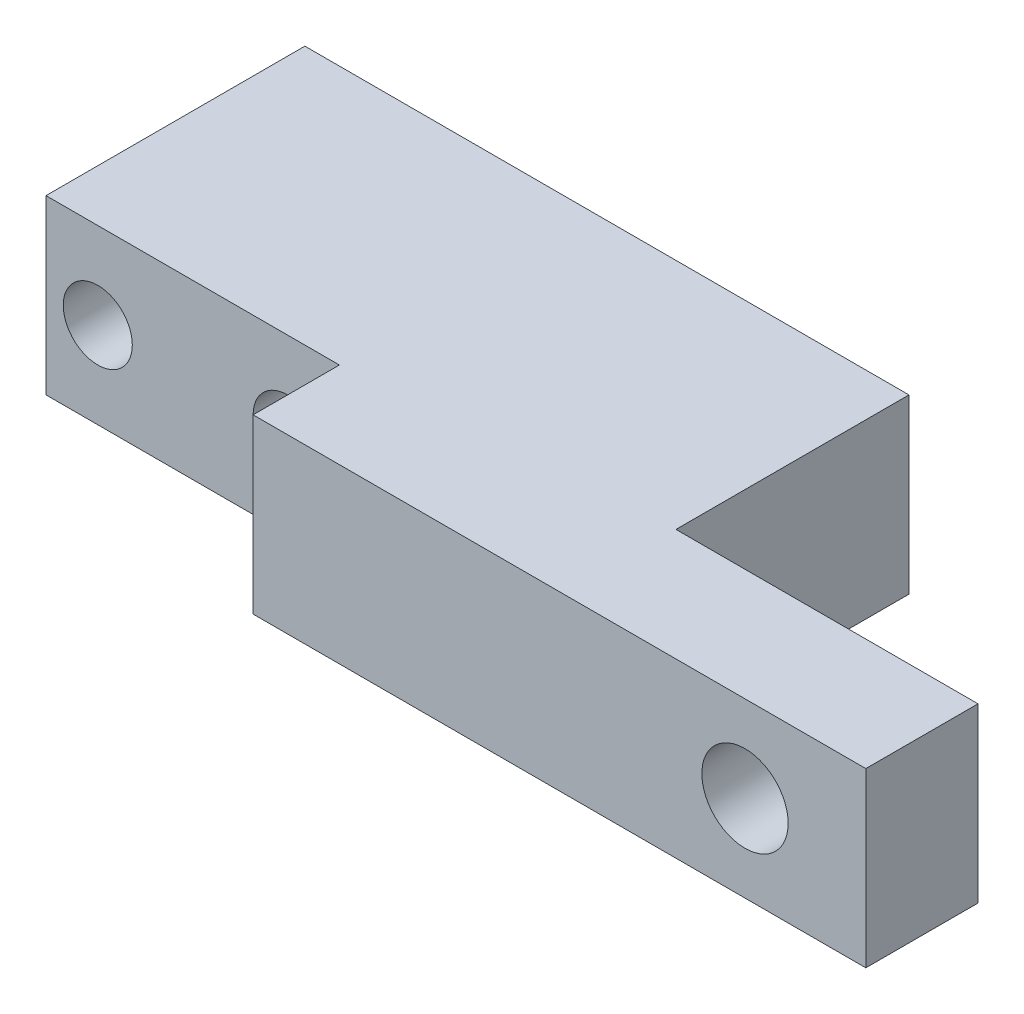
ISO-10303-21;
HEADER;
FILE_DESCRIPTION(('STEP AP214'),'2;1');
FILE_NAME('part.step','',(''),(''),'','','');
FILE_SCHEMA(('AUTOMOTIVE_DESIGN { 1 0 10303 214 1 1 1 1 }'));
ENDSEC;
DATA;
#1=APPLICATION_CONTEXT('core data for automotive mechanical design processes');
#2=APPLICATION_PROTOCOL_DEFINITION('international standard','automotive_design',2000,#1);
#3=PRODUCT_CONTEXT('',#1,'mechanical');
#4=PRODUCT('Part','Part','',(#3));
#5=PRODUCT_RELATED_PRODUCT_CATEGORY('part','',(#4));
#6=PRODUCT_DEFINITION_FORMATION('','',#4);
#7=PRODUCT_DEFINITION_CONTEXT('part definition',#1,'design');
#8=PRODUCT_DEFINITION('design','',#6,#7);
#9=PRODUCT_DEFINITION_SHAPE('','',#8);
#10=(LENGTH_UNIT() NAMED_UNIT(*) SI_UNIT(.MILLI.,.METRE.));
#11=(NAMED_UNIT(*) PLANE_ANGLE_UNIT() SI_UNIT($,.RADIAN.));
#12=(NAMED_UNIT(*) SI_UNIT($,.STERADIAN.) SOLID_ANGLE_UNIT());
#13=UNCERTAINTY_MEASURE_WITH_UNIT(LENGTH_MEASURE(1.E-05),#10,'distance_accuracy_value','');
#14=(GEOMETRIC_REPRESENTATION_CONTEXT(3) GLOBAL_UNCERTAINTY_ASSIGNED_CONTEXT((#13)) GLOBAL_UNIT_ASSIGNED_CONTEXT((#10,
#11,#12)) REPRESENTATION_CONTEXT('',''));
#15=CARTESIAN_POINT('',(0.,0.,0.));
#16=DIRECTION('',(0.,0.,1.));
#17=DIRECTION('',(1.,0.,0.));
#18=AXIS2_PLACEMENT_3D('',#15,#16,#17);
#19=CARTESIAN_POINT('',(0.,-10.,20.));
#20=DIRECTION('',(1.,0.,0.));
#21=DIRECTION('',(0.,0.,-1.));
#22=AXIS2_PLACEMENT_3D('',#19,#20,#21);
#23=PLANE('',#22);
#24=DIRECTION('',(0.,0.,-1.));
#25=VECTOR('',#24,1.);
#26=CARTESIAN_POINT('',(0.,-10.,20.));
#27=LINE('',#26,#25);
#28=CARTESIAN_POINT('',(0.,-10.,15.));
#29=VERTEX_POINT('',#28);
#30=CARTESIAN_POINT('',(0.,-10.,0.));
#31=VERTEX_POINT('',#30);
#32=EDGE_CURVE('E11',#29,#31,#27,.T.);
#33=ORIENTED_EDGE('',*,*,#32,.F.);
#34=DIRECTION('',(0.,1.,0.));
#35=VECTOR('',#34,1.);
#36=CARTESIAN_POINT('',(0.,-20.,15.));
#37=LINE('',#36,#35);
#38=CARTESIAN_POINT('',(0.,0.,15.));
#39=VERTEX_POINT('',#38);
#40=EDGE_CURVE('E132',#29,#39,#37,.T.);
#41=ORIENTED_EDGE('',*,*,#40,.T.);
#42=DIRECTION('',(0.,0.,-1.));
#43=VECTOR('',#42,1.);
#44=CARTESIAN_POINT('',(0.,0.,20.));
#45=LINE('',#44,#43);
#46=CARTESIAN_POINT('',(0.,0.,0.));
#47=VERTEX_POINT('',#46);
#48=EDGE_CURVE('E164',#39,#47,#45,.T.);
#49=ORIENTED_EDGE('',*,*,#48,.T.);
#50=DIRECTION('',(0.,-1.,0.));
#51=VECTOR('',#50,1.);
#52=CARTESIAN_POINT('',(0.,-10.,0.));
#53=LINE('',#52,#51);
#54=EDGE_CURVE('E155',#47,#31,#53,.T.);
#55=ORIENTED_EDGE('',*,*,#54,.T.);
#56=EDGE_LOOP('',(#33,#41,#49,#55));
#57=FACE_BOUND('',#56,.T.);
#58=ADVANCED_FACE('F33',(#57),#23,.F.);
#59=CARTESIAN_POINT('',(52.5,-9.99999999999999,20.));
#60=DIRECTION('',(0.,1.,0.));
#61=DIRECTION('',(-1.,0.,0.));
#62=AXIS2_PLACEMENT_3D('',#59,#60,#61);
#63=PLANE('',#62);
#64=DIRECTION('',(1.,0.,0.));
#65=VECTOR('',#64,1.);
#66=CARTESIAN_POINT('',(52.5,-9.99999999999999,0.));
#67=LINE('',#66,#65);
#68=CARTESIAN_POINT('',(35.,-9.99999999999999,0.));
#69=VERTEX_POINT('',#68);
#70=EDGE_CURVE('E167',#31,#69,#67,.T.);
#71=ORIENTED_EDGE('',*,*,#70,.T.);
#72=DIRECTION('',(0.,0.,1.));
#73=VECTOR('',#72,1.);
#74=CARTESIAN_POINT('',(35.,-9.99999999999999,20.));
#75=LINE('',#74,#73);
#76=CARTESIAN_POINT('',(35.,-9.99999999999999,13.5));
#77=VERTEX_POINT('',#76);
#78=EDGE_CURVE('E49',#69,#77,#75,.T.);
#79=ORIENTED_EDGE('',*,*,#78,.T.);
#80=DIRECTION('',(1.,0.,0.));
#81=VECTOR('',#80,1.);
#82=CARTESIAN_POINT('',(52.5,-9.99999999999999,13.5));
#83=LINE('',#82,#81);
#84=CARTESIAN_POINT('',(52.5,-9.99999999999999,13.5));
#85=VERTEX_POINT('',#84);
#86=EDGE_CURVE('E105',#77,#85,#83,.T.);
#87=ORIENTED_EDGE('',*,*,#86,.T.);
#88=DIRECTION('',(0.,0.,-1.));
#89=VECTOR('',#88,1.);
#90=CARTESIAN_POINT('',(52.5,-9.99999999999999,20.));
#91=LINE('',#90,#89);
#92=CARTESIAN_POINT('',(52.5,-9.99999999999999,20.));
#93=VERTEX_POINT('',#92);
#94=EDGE_CURVE('E41',#93,#85,#91,.T.);
#95=ORIENTED_EDGE('',*,*,#94,.F.);
#96=DIRECTION('',(1.,0.,0.));
#97=VECTOR('',#96,1.);
#98=CARTESIAN_POINT('',(52.5,-9.99999999999999,20.));
#99=LINE('',#98,#97);
#100=CARTESIAN_POINT('',(17.,-10.,20.));
#101=VERTEX_POINT('',#100);
#102=EDGE_CURVE('E156',#101,#93,#99,.T.);
#103=ORIENTED_EDGE('',*,*,#102,.F.);
#104=DIRECTION('',(0.,0.,-1.));
#105=VECTOR('',#104,1.);
#106=CARTESIAN_POINT('',(17.,-10.,20.));
#107=LINE('',#106,#105);
#108=CARTESIAN_POINT('',(17.,-10.,15.));
#109=VERTEX_POINT('',#108);
#110=EDGE_CURVE('E57',#101,#109,#107,.T.);
#111=ORIENTED_EDGE('',*,*,#110,.T.);
#112=DIRECTION('',(-1.,0.,0.));
#113=VECTOR('',#112,1.);
#114=CARTESIAN_POINT('',(52.5,-9.99999999999999,15.));
#115=LINE('',#114,#113);
#116=EDGE_CURVE('E142',#109,#29,#115,.T.);
#117=ORIENTED_EDGE('',*,*,#116,.T.);
#118=ORIENTED_EDGE('',*,*,#32,.T.);
#119=EDGE_LOOP('',(#71,#79,#87,#95,#103,#111,#117,#118));
#120=FACE_BOUND('',#119,.T.);
#121=ADVANCED_FACE('F198',(#120),#63,.F.);
#122=CARTESIAN_POINT('',(52.5,0.,20.));
#123=DIRECTION('',(-1.,0.,0.));
#124=DIRECTION('',(0.,0.,1.));
#125=AXIS2_PLACEMENT_3D('',#122,#123,#124);
#126=PLANE('',#125);
#127=ORIENTED_EDGE('',*,*,#94,.T.);
#128=DIRECTION('',(0.,1.,0.));
#129=VECTOR('',#128,1.);
#130=CARTESIAN_POINT('',(52.5,-20.,13.5));
#131=LINE('',#130,#129);
#132=CARTESIAN_POINT('',(52.5,0.,13.5));
#133=VERTEX_POINT('',#132);
#134=EDGE_CURVE('E106',#85,#133,#131,.T.);
#135=ORIENTED_EDGE('',*,*,#134,.T.);
#136=DIRECTION('',(0.,0.,-1.));
#137=VECTOR('',#136,1.);
#138=CARTESIAN_POINT('',(52.5,0.,20.));
#139=LINE('',#138,#137);
#140=CARTESIAN_POINT('',(52.5,0.,20.));
#141=VERTEX_POINT('',#140);
#142=EDGE_CURVE('E119',#141,#133,#139,.T.);
#143=ORIENTED_EDGE('',*,*,#142,.F.);
#144=DIRECTION('',(0.,1.,0.));
#145=VECTOR('',#144,1.);
#146=CARTESIAN_POINT('',(52.5,0.,20.));
#147=LINE('',#146,#145);
#148=EDGE_CURVE('E158',#93,#141,#147,.T.);
#149=ORIENTED_EDGE('',*,*,#148,.F.);
#150=EDGE_LOOP('',(#127,#135,#143,#149));
#151=FACE_BOUND('',#150,.T.);
#152=ADVANCED_FACE('F205',(#151),#126,.F.);
#153=CARTESIAN_POINT('',(0.,0.,20.));
#154=DIRECTION('',(0.,-1.,0.));
#155=DIRECTION('',(0.,0.,-1.));
#156=AXIS2_PLACEMENT_3D('',#153,#154,#155);
#157=PLANE('',#156);
#158=DIRECTION('',(1.,0.,0.));
#159=VECTOR('',#158,1.);
#160=CARTESIAN_POINT('',(35.,0.,13.5));
#161=LINE('',#160,#159);
#162=CARTESIAN_POINT('',(35.,0.,13.5));
#163=VERTEX_POINT('',#162);
#164=EDGE_CURVE('E102',#163,#133,#161,.T.);
#165=ORIENTED_EDGE('',*,*,#164,.F.);
#166=DIRECTION('',(0.,0.,1.));
#167=VECTOR('',#166,1.);
#168=CARTESIAN_POINT('',(35.,0.,13.5));
#169=LINE('',#168,#167);
#170=CARTESIAN_POINT('',(35.,0.,0.));
#171=VERTEX_POINT('',#170);
#172=EDGE_CURVE('E109',#171,#163,#169,.T.);
#173=ORIENTED_EDGE('',*,*,#172,.F.);
#174=DIRECTION('',(-1.,0.,0.));
#175=VECTOR('',#174,1.);
#176=CARTESIAN_POINT('',(0.,0.,0.));
#177=LINE('',#176,#175);
#178=EDGE_CURVE('E159',#171,#47,#177,.T.);
#179=ORIENTED_EDGE('',*,*,#178,.T.);
#180=ORIENTED_EDGE('',*,*,#48,.F.);
#181=DIRECTION('',(-1.,0.,0.));
#182=VECTOR('',#181,1.);
#183=CARTESIAN_POINT('',(17.,0.,15.));
#184=LINE('',#183,#182);
#185=CARTESIAN_POINT('',(17.,0.,15.));
#186=VERTEX_POINT('',#185);
#187=EDGE_CURVE('E129',#186,#39,#184,.T.);
#188=ORIENTED_EDGE('',*,*,#187,.F.);
#189=DIRECTION('',(0.,0.,-1.));
#190=VECTOR('',#189,1.);
#191=CARTESIAN_POINT('',(17.,0.,20.));
#192=LINE('',#191,#190);
#193=CARTESIAN_POINT('',(17.,0.,20.));
#194=VERTEX_POINT('',#193);
#195=EDGE_CURVE('E126',#194,#186,#192,.T.);
#196=ORIENTED_EDGE('',*,*,#195,.F.);
#197=DIRECTION('',(-1.,0.,0.));
#198=VECTOR('',#197,1.);
#199=CARTESIAN_POINT('',(0.,0.,20.));
#200=LINE('',#199,#198);
#201=EDGE_CURVE('E161',#141,#194,#200,.T.);
#202=ORIENTED_EDGE('',*,*,#201,.F.);
#203=ORIENTED_EDGE('',*,*,#142,.T.);
#204=EDGE_LOOP('',(#165,#173,#179,#180,#188,#196,#202,#203));
#205=FACE_BOUND('',#204,.T.);
#206=ADVANCED_FACE('F116',(#205),#157,.F.);
#207=CARTESIAN_POINT('',(0.,0.,20.));
#208=DIRECTION('',(0.,0.,-1.));
#209=DIRECTION('',(-1.,0.,0.));
#210=AXIS2_PLACEMENT_3D('',#207,#208,#209);
#211=PLANE('',#210);
#212=CARTESIAN_POINT('',(45.5,-5.,20.));
#213=DIRECTION('',(0.,0.,1.));
#214=DIRECTION('',(1.,0.,0.));
#215=AXIS2_PLACEMENT_3D('',#212,#213,#214);
#216=CIRCLE('',#215,2.49999999999999);
#217=CARTESIAN_POINT('',(48.,-5.,20.));
#218=VERTEX_POINT('',#217);
#219=EDGE_CURVE('E146',#218,#218,#216,.T.);
#220=ORIENTED_EDGE('',*,*,#219,.F.);
#221=EDGE_LOOP('',(#220));
#222=FACE_BOUND('',#221,.T.);
#223=ORIENTED_EDGE('',*,*,#201,.T.);
#224=DIRECTION('',(0.,1.,0.));
#225=VECTOR('',#224,1.);
#226=CARTESIAN_POINT('',(17.,-20.,20.));
#227=LINE('',#226,#225);
#228=EDGE_CURVE('E131',#101,#194,#227,.T.);
#229=ORIENTED_EDGE('',*,*,#228,.F.);
#230=ORIENTED_EDGE('',*,*,#102,.T.);
#231=ORIENTED_EDGE('',*,*,#148,.T.);
#232=EDGE_LOOP('',(#223,#229,#230,#231));
#233=FACE_BOUND('',#232,.T.);
#234=ADVANCED_FACE('F203',(#222,#233),#211,.F.);
#235=CARTESIAN_POINT('',(0.,0.,0.));
#236=DIRECTION('',(0.,0.,-1.));
#237=DIRECTION('',(-1.,0.,0.));
#238=AXIS2_PLACEMENT_3D('',#235,#236,#237);
#239=PLANE('',#238);
#240=DIRECTION('',(0.,1.,0.));
#241=VECTOR('',#240,1.);
#242=CARTESIAN_POINT('',(35.,-20.,0.));
#243=LINE('',#242,#241);
#244=EDGE_CURVE('E111',#69,#171,#243,.T.);
#245=ORIENTED_EDGE('',*,*,#244,.F.);
#246=ORIENTED_EDGE('',*,*,#70,.F.);
#247=ORIENTED_EDGE('',*,*,#54,.F.);
#248=ORIENTED_EDGE('',*,*,#178,.F.);
#249=EDGE_LOOP('',(#245,#246,#247,#248));
#250=FACE_BOUND('',#249,.T.);
#251=CARTESIAN_POINT('',(14.,-5.,0.));
#252=DIRECTION('',(0.,0.,1.));
#253=DIRECTION('',(1.,0.,0.));
#254=AXIS2_PLACEMENT_3D('',#251,#252,#253);
#255=CIRCLE('',#254,2.);
#256=CARTESIAN_POINT('',(16.,-5.,0.));
#257=VERTEX_POINT('',#256);
#258=EDGE_CURVE('E149',#257,#257,#255,.T.);
#259=ORIENTED_EDGE('',*,*,#258,.T.);
#260=EDGE_LOOP('',(#259));
#261=FACE_BOUND('',#260,.T.);
#262=CARTESIAN_POINT('',(3.,-5.,0.));
#263=DIRECTION('',(0.,0.,1.));
#264=DIRECTION('',(1.,0.,0.));
#265=AXIS2_PLACEMENT_3D('',#262,#263,#264);
#266=CIRCLE('',#265,2.);
#267=CARTESIAN_POINT('',(5.,-5.,0.));
#268=VERTEX_POINT('',#267);
#269=EDGE_CURVE('E152',#268,#268,#266,.T.);
#270=ORIENTED_EDGE('',*,*,#269,.T.);
#271=EDGE_LOOP('',(#270));
#272=FACE_BOUND('',#271,.T.);
#273=ADVANCED_FACE('F195',(#250,#261,#272),#239,.T.);
#274=CARTESIAN_POINT('',(3.,-5.,0.));
#275=DIRECTION('',(0.,0.,1.));
#276=DIRECTION('',(1.,0.,0.));
#277=AXIS2_PLACEMENT_3D('',#274,#275,#276);
#278=CYLINDRICAL_SURFACE('',#277,2.);
#279=CARTESIAN_POINT('',(3.,-5.,15.));
#280=DIRECTION('',(0.,0.,-1.));
#281=DIRECTION('',(-1.,0.,0.));
#282=AXIS2_PLACEMENT_3D('',#279,#280,#281);
#283=CIRCLE('',#282,2.);
#284=CARTESIAN_POINT('',(1.,-5.,15.));
#285=VERTEX_POINT('',#284);
#286=EDGE_CURVE('E139',#285,#285,#283,.F.);
#287=ORIENTED_EDGE('',*,*,#286,.T.);
#288=EDGE_LOOP('',(#287));
#289=FACE_BOUND('',#288,.T.);
#290=ORIENTED_EDGE('',*,*,#269,.F.);
#291=EDGE_LOOP('',(#290));
#292=FACE_BOUND('',#291,.T.);
#293=ADVANCED_FACE('F248',(#289,#292),#278,.F.);
#294=CARTESIAN_POINT('',(14.,-5.,0.));
#295=DIRECTION('',(0.,0.,1.));
#296=DIRECTION('',(1.,0.,0.));
#297=AXIS2_PLACEMENT_3D('',#294,#295,#296);
#298=CYLINDRICAL_SURFACE('',#297,2.);
#299=CARTESIAN_POINT('',(14.,-5.,15.));
#300=DIRECTION('',(0.,0.,-1.));
#301=DIRECTION('',(-1.,0.,0.));
#302=AXIS2_PLACEMENT_3D('',#299,#300,#301);
#303=CIRCLE('',#302,2.);
#304=CARTESIAN_POINT('',(12.,-5.,15.));
#305=VERTEX_POINT('',#304);
#306=EDGE_CURVE('E135',#305,#305,#303,.F.);
#307=ORIENTED_EDGE('',*,*,#306,.T.);
#308=EDGE_LOOP('',(#307));
#309=FACE_BOUND('',#308,.T.);
#310=ORIENTED_EDGE('',*,*,#258,.F.);
#311=EDGE_LOOP('',(#310));
#312=FACE_BOUND('',#311,.T.);
#313=ADVANCED_FACE('F178',(#309,#312),#298,.F.);
#314=CARTESIAN_POINT('',(45.5,-5.,0.));
#315=DIRECTION('',(0.,0.,1.));
#316=DIRECTION('',(1.,0.,0.));
#317=AXIS2_PLACEMENT_3D('',#314,#315,#316);
#318=CYLINDRICAL_SURFACE('',#317,2.49999999999999);
#319=CARTESIAN_POINT('',(45.5,-5.,13.5));
#320=DIRECTION('',(0.,0.,1.));
#321=DIRECTION('',(1.,0.,0.));
#322=AXIS2_PLACEMENT_3D('',#319,#320,#321);
#323=CIRCLE('',#322,2.49999999999999);
#324=CARTESIAN_POINT('',(48.,-5.,13.5));
#325=VERTEX_POINT('',#324);
#326=EDGE_CURVE('E36',#325,#325,#323,.F.);
#327=ORIENTED_EDGE('',*,*,#326,.T.);
#328=EDGE_LOOP('',(#327));
#329=FACE_BOUND('',#328,.T.);
#330=ORIENTED_EDGE('',*,*,#219,.T.);
#331=EDGE_LOOP('',(#330));
#332=FACE_BOUND('',#331,.T.);
#333=ADVANCED_FACE('F266',(#329,#332),#318,.F.);
#334=CARTESIAN_POINT('',(17.,-20.,20.));
#335=DIRECTION('',(1.,0.,0.));
#336=DIRECTION('',(0.,0.,-1.));
#337=AXIS2_PLACEMENT_3D('',#334,#335,#336);
#338=PLANE('',#337);
#339=ORIENTED_EDGE('',*,*,#228,.T.);
#340=ORIENTED_EDGE('',*,*,#195,.T.);
#341=DIRECTION('',(0.,1.,0.));
#342=VECTOR('',#341,1.);
#343=CARTESIAN_POINT('',(17.,-20.,15.));
#344=LINE('',#343,#342);
#345=EDGE_CURVE('E136',#109,#186,#344,.T.);
#346=ORIENTED_EDGE('',*,*,#345,.F.);
#347=ORIENTED_EDGE('',*,*,#110,.F.);
#348=EDGE_LOOP('',(#339,#340,#346,#347));
#349=FACE_BOUND('',#348,.T.);
#350=ADVANCED_FACE('F184',(#349),#338,.F.);
#351=CARTESIAN_POINT('',(17.,-20.,15.));
#352=DIRECTION('',(0.,0.,-1.));
#353=DIRECTION('',(-1.,0.,0.));
#354=AXIS2_PLACEMENT_3D('',#351,#352,#353);
#355=PLANE('',#354);
#356=ORIENTED_EDGE('',*,*,#286,.F.);
#357=EDGE_LOOP('',(#356));
#358=FACE_BOUND('',#357,.T.);
#359=ORIENTED_EDGE('',*,*,#306,.F.);
#360=EDGE_LOOP('',(#359));
#361=FACE_BOUND('',#360,.T.);
#362=ORIENTED_EDGE('',*,*,#345,.T.);
#363=ORIENTED_EDGE('',*,*,#187,.T.);
#364=ORIENTED_EDGE('',*,*,#40,.F.);
#365=ORIENTED_EDGE('',*,*,#116,.F.);
#366=EDGE_LOOP('',(#362,#363,#364,#365));
#367=FACE_BOUND('',#366,.T.);
#368=ADVANCED_FACE('F181',(#358,#361,#367),#355,.F.);
#369=CARTESIAN_POINT('',(35.,-20.,13.5));
#370=DIRECTION('',(-1.,0.,0.));
#371=DIRECTION('',(0.,0.,1.));
#372=AXIS2_PLACEMENT_3D('',#369,#370,#371);
#373=PLANE('',#372);
#374=ORIENTED_EDGE('',*,*,#244,.T.);
#375=ORIENTED_EDGE('',*,*,#172,.T.);
#376=DIRECTION('',(0.,1.,0.));
#377=VECTOR('',#376,1.);
#378=CARTESIAN_POINT('',(35.,-20.,13.5));
#379=LINE('',#378,#377);
#380=EDGE_CURVE('E98',#77,#163,#379,.T.);
#381=ORIENTED_EDGE('',*,*,#380,.F.);
#382=ORIENTED_EDGE('',*,*,#78,.F.);
#383=EDGE_LOOP('',(#374,#375,#381,#382));
#384=FACE_BOUND('',#383,.T.);
#385=ADVANCED_FACE('F110',(#384),#373,.F.);
#386=CARTESIAN_POINT('',(35.,-20.,13.5));
#387=DIRECTION('',(0.,0.,1.));
#388=DIRECTION('',(1.,0.,0.));
#389=AXIS2_PLACEMENT_3D('',#386,#387,#388);
#390=PLANE('',#389);
#391=ORIENTED_EDGE('',*,*,#326,.F.);
#392=EDGE_LOOP('',(#391));
#393=FACE_BOUND('',#392,.T.);
#394=ORIENTED_EDGE('',*,*,#380,.T.);
#395=ORIENTED_EDGE('',*,*,#164,.T.);
#396=ORIENTED_EDGE('',*,*,#134,.F.);
#397=ORIENTED_EDGE('',*,*,#86,.F.);
#398=EDGE_LOOP('',(#394,#395,#396,#397));
#399=FACE_BOUND('',#398,.T.);
#400=ADVANCED_FACE('F100',(#393,#399),#390,.F.);
#401=CLOSED_SHELL('',(#58,#121,#152,#206,#234,#273,#293,#313,#333,#350,#368,#385,#400));
#402=MANIFOLD_SOLID_BREP('B2',#401);
#403=ADVANCED_BREP_SHAPE_REPRESENTATION('',(#18,#402),#14);
#404=SHAPE_DEFINITION_REPRESENTATION(#9,#403);
ENDSEC;
END-ISO-10303-21;
